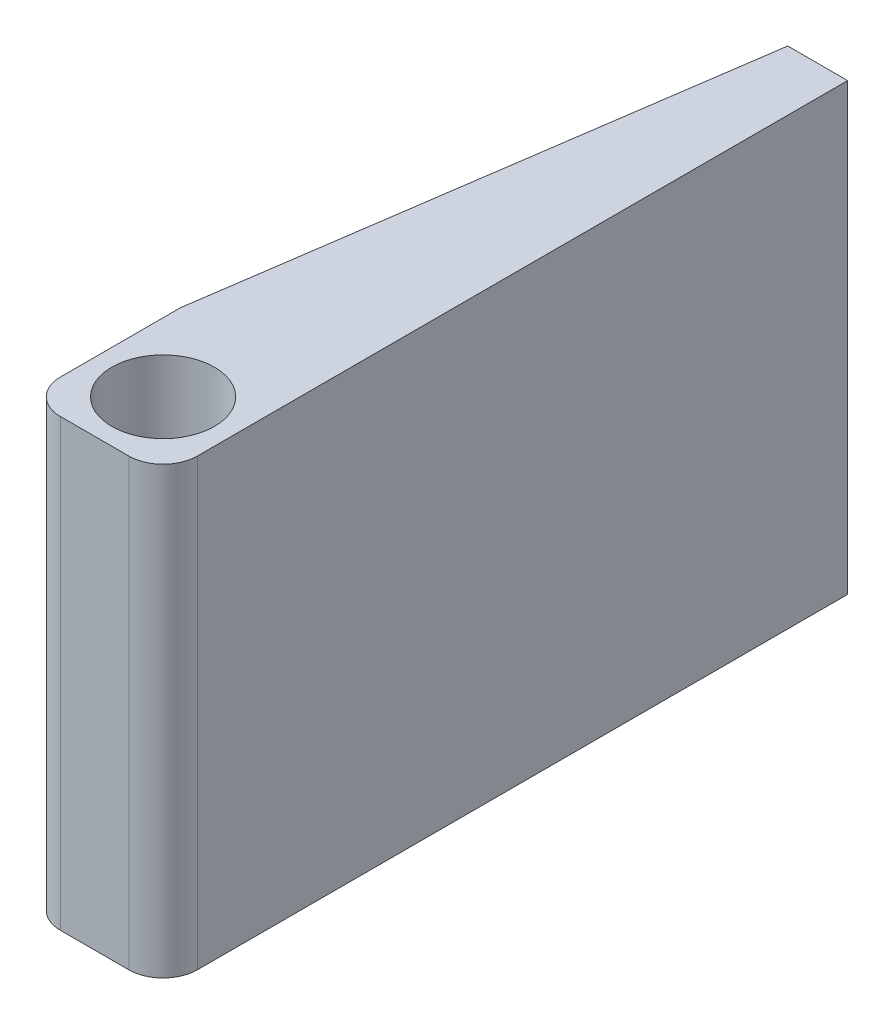
ISO-10303-21;
HEADER;
FILE_DESCRIPTION(('STEP AP214'),'2;1');
FILE_NAME('part.step','',(''),(''),'','','');
FILE_SCHEMA(('AUTOMOTIVE_DESIGN { 1 0 10303 214 1 1 1 1 }'));
ENDSEC;
DATA;
#1=APPLICATION_CONTEXT('core data for automotive mechanical design processes');
#2=APPLICATION_PROTOCOL_DEFINITION('international standard','automotive_design',2000,#1);
#3=PRODUCT_CONTEXT('',#1,'mechanical');
#4=PRODUCT('Part','Part','',(#3));
#5=PRODUCT_RELATED_PRODUCT_CATEGORY('part','',(#4));
#6=PRODUCT_DEFINITION_FORMATION('','',#4);
#7=PRODUCT_DEFINITION_CONTEXT('part definition',#1,'design');
#8=PRODUCT_DEFINITION('design','',#6,#7);
#9=PRODUCT_DEFINITION_SHAPE('','',#8);
#10=(LENGTH_UNIT() NAMED_UNIT(*) SI_UNIT(.MILLI.,.METRE.));
#11=(NAMED_UNIT(*) PLANE_ANGLE_UNIT() SI_UNIT($,.RADIAN.));
#12=(NAMED_UNIT(*) SI_UNIT($,.STERADIAN.) SOLID_ANGLE_UNIT());
#13=UNCERTAINTY_MEASURE_WITH_UNIT(LENGTH_MEASURE(1.E-05),#10,'distance_accuracy_value','');
#14=(GEOMETRIC_REPRESENTATION_CONTEXT(3) GLOBAL_UNCERTAINTY_ASSIGNED_CONTEXT((#13)) GLOBAL_UNIT_ASSIGNED_CONTEXT((#10,
#11,#12)) REPRESENTATION_CONTEXT('',''));
#15=CARTESIAN_POINT('',(0.,0.,0.));
#16=DIRECTION('',(0.,0.,1.));
#17=DIRECTION('',(1.,0.,0.));
#18=AXIS2_PLACEMENT_3D('',#15,#16,#17);
#19=CARTESIAN_POINT('',(101.6,198.344869215292,155.364185110664));
#20=DIRECTION('',(0.,0.,-1.));
#21=DIRECTION('',(0.,1.,0.));
#22=AXIS2_PLACEMENT_3D('',#19,#20,#21);
#23=PLANE('',#22);
#24=DIRECTION('',(-1.,0.,0.));
#25=VECTOR('',#24,1.);
#26=CARTESIAN_POINT('',(101.6,198.344869215292,155.364185110664));
#27=LINE('',#26,#25);
#28=CARTESIAN_POINT('',(76.2,198.344869215292,155.364185110664));
#29=VERTEX_POINT('',#28);
#30=CARTESIAN_POINT('',(25.4,198.344869215292,155.364185110664));
#31=VERTEX_POINT('',#30);
#32=EDGE_CURVE('E183',#29,#31,#27,.T.);
#33=ORIENTED_EDGE('',*,*,#32,.T.);
#34=DIRECTION('',(0.,-1.,0.));
#35=VECTOR('',#34,1.);
#36=CARTESIAN_POINT('',(25.4,198.344869215292,155.364185110664));
#37=LINE('',#36,#35);
#38=CARTESIAN_POINT('',(25.4,-131.855130784708,155.364185110664));
#39=VERTEX_POINT('',#38);
#40=EDGE_CURVE('E200',#31,#39,#37,.T.);
#41=ORIENTED_EDGE('',*,*,#40,.T.);
#42=DIRECTION('',(-1.,0.,0.));
#43=VECTOR('',#42,1.);
#44=CARTESIAN_POINT('',(101.6,-131.855130784708,155.364185110664));
#45=LINE('',#44,#43);
#46=CARTESIAN_POINT('',(76.2,-131.855130784708,155.364185110664));
#47=VERTEX_POINT('',#46);
#48=EDGE_CURVE('E195',#47,#39,#45,.T.);
#49=ORIENTED_EDGE('',*,*,#48,.F.);
#50=DIRECTION('',(0.,-1.,0.));
#51=VECTOR('',#50,1.);
#52=CARTESIAN_POINT('',(76.2,198.344869215292,155.364185110664));
#53=LINE('',#52,#51);
#54=EDGE_CURVE('E198',#47,#29,#53,.F.);
#55=ORIENTED_EDGE('',*,*,#54,.T.);
#56=EDGE_LOOP('',(#33,#41,#49,#55));
#57=FACE_BOUND('',#56,.T.);
#58=ADVANCED_FACE('F39',(#57),#23,.F.);
#59=CARTESIAN_POINT('',(101.6,-131.855130784708,155.364185110664));
#60=DIRECTION('',(0.,1.,0.));
#61=DIRECTION('',(0.,0.,1.));
#62=AXIS2_PLACEMENT_3D('',#59,#60,#61);
#63=PLANE('',#62);
#64=CARTESIAN_POINT('',(50.8,-131.855130784708,104.564185110664));
#65=DIRECTION('',(0.,-1.,0.));
#66=DIRECTION('',(0.,0.,-1.));
#67=AXIS2_PLACEMENT_3D('',#64,#65,#66);
#68=CIRCLE('',#67,38.1);
#69=CARTESIAN_POINT('',(50.8,-131.855130784708,66.464185110664));
#70=VERTEX_POINT('',#69);
#71=EDGE_CURVE('E167',#70,#70,#68,.T.);
#72=ORIENTED_EDGE('',*,*,#71,.F.);
#73=EDGE_LOOP('',(#72));
#74=FACE_BOUND('',#73,.T.);
#75=DIRECTION('',(0.,0.,-1.));
#76=VECTOR('',#75,1.);
#77=CARTESIAN_POINT('',(0.,-131.855130784708,155.364185110664));
#78=LINE('',#77,#76);
#79=CARTESIAN_POINT('',(0.,-131.855130784708,129.964185110664));
#80=VERTEX_POINT('',#79);
#81=CARTESIAN_POINT('',(0.,-131.855130784708,40.9592464621144));
#82=VERTEX_POINT('',#81);
#83=EDGE_CURVE('E172',#80,#82,#78,.T.);
#84=ORIENTED_EDGE('',*,*,#83,.T.);
#85=DIRECTION('',(-0.143693149340155,0.,0.98962229099425));
#86=VECTOR('',#85,1.);
#87=CARTESIAN_POINT('',(0.,-131.855130784708,40.9592464621144));
#88=LINE('',#87,#86);
#89=CARTESIAN_POINT('',(57.15,-131.855130784708,-352.635814889336));
#90=VERTEX_POINT('',#89);
#91=EDGE_CURVE('E62',#90,#82,#88,.T.);
#92=ORIENTED_EDGE('',*,*,#91,.F.);
#93=DIRECTION('',(-1.,0.,0.));
#94=VECTOR('',#93,1.);
#95=CARTESIAN_POINT('',(101.6,-131.855130784708,-352.635814889336));
#96=LINE('',#95,#94);
#97=CARTESIAN_POINT('',(101.6,-131.855130784708,-352.635814889336));
#98=VERTEX_POINT('',#97);
#99=EDGE_CURVE('E192',#98,#90,#96,.T.);
#100=ORIENTED_EDGE('',*,*,#99,.F.);
#101=DIRECTION('',(0.,0.,-1.));
#102=VECTOR('',#101,1.);
#103=CARTESIAN_POINT('',(101.6,-131.855130784708,155.364185110664));
#104=LINE('',#103,#102);
#105=CARTESIAN_POINT('',(101.6,-131.855130784708,129.964185110664));
#106=VERTEX_POINT('',#105);
#107=EDGE_CURVE('E175',#106,#98,#104,.T.);
#108=ORIENTED_EDGE('',*,*,#107,.F.);
#109=CARTESIAN_POINT('',(76.2,-131.855130784708,129.964185110664));
#110=DIRECTION('',(0.,1.,0.));
#111=DIRECTION('',(0.,0.,1.));
#112=AXIS2_PLACEMENT_3D('',#109,#110,#111);
#113=CIRCLE('',#112,25.4);
#114=EDGE_CURVE('E203',#106,#47,#113,.F.);
#115=ORIENTED_EDGE('',*,*,#114,.T.);
#116=ORIENTED_EDGE('',*,*,#48,.T.);
#117=CARTESIAN_POINT('',(25.4,-131.855130784708,129.964185110664));
#118=DIRECTION('',(0.,1.,0.));
#119=DIRECTION('',(0.,0.,1.));
#120=AXIS2_PLACEMENT_3D('',#117,#118,#119);
#121=CIRCLE('',#120,25.4);
#122=EDGE_CURVE('E205',#39,#80,#121,.F.);
#123=ORIENTED_EDGE('',*,*,#122,.T.);
#124=EDGE_LOOP('',(#84,#92,#100,#108,#115,#116,#123));
#125=FACE_BOUND('',#124,.T.);
#126=ADVANCED_FACE('F226',(#74,#125),#63,.F.);
#127=CARTESIAN_POINT('',(101.6,198.344869215292,-352.635814889336));
#128=DIRECTION('',(0.,0.,1.));
#129=DIRECTION('',(0.,-1.,0.));
#130=AXIS2_PLACEMENT_3D('',#127,#128,#129);
#131=PLANE('',#130);
#132=DIRECTION('',(-1.,0.,0.));
#133=VECTOR('',#132,1.);
#134=CARTESIAN_POINT('',(91.44,-4.85513078470822,-352.635814889336));
#135=LINE('',#134,#133);
#136=CARTESIAN_POINT('',(91.44,-4.8551307847082,-352.635814889336));
#137=VERTEX_POINT('',#136);
#138=CARTESIAN_POINT('',(68.3357247994708,-4.85513078470822,-352.635814889336));
#139=VERTEX_POINT('',#138);
#140=EDGE_CURVE('E151',#137,#139,#135,.T.);
#141=ORIENTED_EDGE('',*,*,#140,.F.);
#142=DIRECTION('',(0.,-1.,0.));
#143=VECTOR('',#142,1.);
#144=CARTESIAN_POINT('',(91.44,71.3448692152918,-352.635814889336));
#145=LINE('',#144,#143);
#146=CARTESIAN_POINT('',(91.44,71.3448692152918,-352.635814889336));
#147=VERTEX_POINT('',#146);
#148=EDGE_CURVE('E54',#147,#137,#145,.T.);
#149=ORIENTED_EDGE('',*,*,#148,.F.);
#150=DIRECTION('',(1.,0.,0.));
#151=VECTOR('',#150,1.);
#152=CARTESIAN_POINT('',(91.44,71.3448692152918,-352.635814889336));
#153=LINE('',#152,#151);
#154=CARTESIAN_POINT('',(68.3357247994708,71.3448692152918,-352.635814889336));
#155=VERTEX_POINT('',#154);
#156=EDGE_CURVE('E142',#155,#147,#153,.T.);
#157=ORIENTED_EDGE('',*,*,#156,.F.);
#158=DIRECTION('',(0.,1.,0.));
#159=VECTOR('',#158,1.);
#160=CARTESIAN_POINT('',(68.3357247994708,71.3448692152918,-352.635814889336));
#161=LINE('',#160,#159);
#162=EDGE_CURVE('E145',#139,#155,#161,.T.);
#163=ORIENTED_EDGE('',*,*,#162,.F.);
#164=EDGE_LOOP('',(#141,#149,#157,#163));
#165=FACE_BOUND('',#164,.T.);
#166=ORIENTED_EDGE('',*,*,#99,.T.);
#167=DIRECTION('',(0.,-1.,0.));
#168=VECTOR('',#167,1.);
#169=CARTESIAN_POINT('',(57.15,198.344869215292,-352.635814889336));
#170=LINE('',#169,#168);
#171=CARTESIAN_POINT('',(57.15,198.344869215292,-352.635814889336));
#172=VERTEX_POINT('',#171);
#173=EDGE_CURVE('E163',#172,#90,#170,.T.);
#174=ORIENTED_EDGE('',*,*,#173,.F.);
#175=DIRECTION('',(-1.,0.,0.));
#176=VECTOR('',#175,1.);
#177=CARTESIAN_POINT('',(101.6,198.344869215292,-352.635814889336));
#178=LINE('',#177,#176);
#179=CARTESIAN_POINT('',(101.6,198.344869215292,-352.635814889336));
#180=VERTEX_POINT('',#179);
#181=EDGE_CURVE('E189',#180,#172,#178,.T.);
#182=ORIENTED_EDGE('',*,*,#181,.F.);
#183=DIRECTION('',(0.,1.,0.));
#184=VECTOR('',#183,1.);
#185=CARTESIAN_POINT('',(101.6,198.344869215292,-352.635814889336));
#186=LINE('',#185,#184);
#187=EDGE_CURVE('E177',#98,#180,#186,.T.);
#188=ORIENTED_EDGE('',*,*,#187,.F.);
#189=EDGE_LOOP('',(#166,#174,#182,#188));
#190=FACE_BOUND('',#189,.T.);
#191=ADVANCED_FACE('F235',(#165,#190),#131,.F.);
#192=CARTESIAN_POINT('',(101.6,198.344869215292,155.364185110664));
#193=DIRECTION('',(0.,-1.,0.));
#194=DIRECTION('',(0.,0.,-1.));
#195=AXIS2_PLACEMENT_3D('',#192,#193,#194);
#196=PLANE('',#195);
#197=CARTESIAN_POINT('',(50.8,198.344869215292,104.564185110664));
#198=DIRECTION('',(0.,-1.,0.));
#199=DIRECTION('',(0.,0.,-1.));
#200=AXIS2_PLACEMENT_3D('',#197,#198,#199);
#201=CIRCLE('',#200,38.1);
#202=CARTESIAN_POINT('',(50.8,198.344869215292,66.464185110664));
#203=VERTEX_POINT('',#202);
#204=EDGE_CURVE('E169',#203,#203,#201,.T.);
#205=ORIENTED_EDGE('',*,*,#204,.T.);
#206=EDGE_LOOP('',(#205));
#207=FACE_BOUND('',#206,.T.);
#208=ORIENTED_EDGE('',*,*,#181,.T.);
#209=DIRECTION('',(-0.143693149340155,0.,0.98962229099425));
#210=VECTOR('',#209,1.);
#211=CARTESIAN_POINT('',(0.,198.344869215292,40.9592464621144));
#212=LINE('',#211,#210);
#213=CARTESIAN_POINT('',(0.,198.344869215292,40.9592464621144));
#214=VERTEX_POINT('',#213);
#215=EDGE_CURVE('E160',#172,#214,#212,.T.);
#216=ORIENTED_EDGE('',*,*,#215,.T.);
#217=DIRECTION('',(0.,0.,1.));
#218=VECTOR('',#217,1.);
#219=CARTESIAN_POINT('',(0.,198.344869215292,155.364185110664));
#220=LINE('',#219,#218);
#221=CARTESIAN_POINT('',(0.,198.344869215292,129.964185110664));
#222=VERTEX_POINT('',#221);
#223=EDGE_CURVE('E178',#214,#222,#220,.T.);
#224=ORIENTED_EDGE('',*,*,#223,.T.);
#225=CARTESIAN_POINT('',(25.4,198.344869215292,129.964185110664));
#226=DIRECTION('',(0.,-1.,0.));
#227=DIRECTION('',(0.,0.,-1.));
#228=AXIS2_PLACEMENT_3D('',#225,#226,#227);
#229=CIRCLE('',#228,25.4);
#230=EDGE_CURVE('E47',#222,#31,#229,.F.);
#231=ORIENTED_EDGE('',*,*,#230,.T.);
#232=ORIENTED_EDGE('',*,*,#32,.F.);
#233=CARTESIAN_POINT('',(76.2,198.344869215292,129.964185110664));
#234=DIRECTION('',(0.,-1.,0.));
#235=DIRECTION('',(0.,0.,-1.));
#236=AXIS2_PLACEMENT_3D('',#233,#234,#235);
#237=CIRCLE('',#236,25.4);
#238=CARTESIAN_POINT('',(101.6,198.344869215292,129.964185110664));
#239=VERTEX_POINT('',#238);
#240=EDGE_CURVE('E210',#29,#239,#237,.F.);
#241=ORIENTED_EDGE('',*,*,#240,.T.);
#242=DIRECTION('',(0.,0.,1.));
#243=VECTOR('',#242,1.);
#244=CARTESIAN_POINT('',(101.6,198.344869215292,155.364185110664));
#245=LINE('',#244,#243);
#246=EDGE_CURVE('E180',#180,#239,#245,.T.);
#247=ORIENTED_EDGE('',*,*,#246,.F.);
#248=EDGE_LOOP('',(#208,#216,#224,#231,#232,#241,#247));
#249=FACE_BOUND('',#248,.T.);
#250=ADVANCED_FACE('F214',(#207,#249),#196,.F.);
#251=CARTESIAN_POINT('',(101.6,0.,0.));
#252=DIRECTION('',(1.,0.,0.));
#253=DIRECTION('',(0.,0.,-1.));
#254=AXIS2_PLACEMENT_3D('',#251,#252,#253);
#255=PLANE('',#254);
#256=ORIENTED_EDGE('',*,*,#246,.T.);
#257=DIRECTION('',(0.,-1.,0.));
#258=VECTOR('',#257,1.);
#259=CARTESIAN_POINT('',(101.6,-131.855130784708,129.964185110664));
#260=LINE('',#259,#258);
#261=EDGE_CURVE('E11',#239,#106,#260,.T.);
#262=ORIENTED_EDGE('',*,*,#261,.T.);
#263=ORIENTED_EDGE('',*,*,#107,.T.);
#264=ORIENTED_EDGE('',*,*,#187,.T.);
#265=EDGE_LOOP('',(#256,#262,#263,#264));
#266=FACE_BOUND('',#265,.T.);
#267=ADVANCED_FACE('F239',(#266),#255,.T.);
#268=CARTESIAN_POINT('',(0.,0.,0.));
#269=DIRECTION('',(1.,0.,0.));
#270=DIRECTION('',(0.,0.,-1.));
#271=AXIS2_PLACEMENT_3D('',#268,#269,#270);
#272=PLANE('',#271);
#273=ORIENTED_EDGE('',*,*,#223,.F.);
#274=DIRECTION('',(0.,-1.,0.));
#275=VECTOR('',#274,1.);
#276=CARTESIAN_POINT('',(0.,198.344869215292,40.9592464621144));
#277=LINE('',#276,#275);
#278=EDGE_CURVE('E165',#214,#82,#277,.T.);
#279=ORIENTED_EDGE('',*,*,#278,.T.);
#280=ORIENTED_EDGE('',*,*,#83,.F.);
#281=DIRECTION('',(0.,-1.,0.));
#282=VECTOR('',#281,1.);
#283=CARTESIAN_POINT('',(0.,0.,129.964185110664));
#284=LINE('',#283,#282);
#285=EDGE_CURVE('E207',#80,#222,#284,.F.);
#286=ORIENTED_EDGE('',*,*,#285,.T.);
#287=EDGE_LOOP('',(#273,#279,#280,#286));
#288=FACE_BOUND('',#287,.T.);
#289=ADVANCED_FACE('F228',(#288),#272,.F.);
#290=CARTESIAN_POINT('',(50.8,198.344869215292,104.564185110664));
#291=DIRECTION('',(0.,-1.,0.));
#292=DIRECTION('',(0.,0.,-1.));
#293=AXIS2_PLACEMENT_3D('',#290,#291,#292);
#294=CYLINDRICAL_SURFACE('',#293,38.1);
#295=ORIENTED_EDGE('',*,*,#204,.F.);
#296=EDGE_LOOP('',(#295));
#297=FACE_BOUND('',#296,.T.);
#298=ORIENTED_EDGE('',*,*,#71,.T.);
#299=EDGE_LOOP('',(#298));
#300=FACE_BOUND('',#299,.T.);
#301=ADVANCED_FACE('F249',(#297,#300),#294,.F.);
#302=CARTESIAN_POINT('',(25.4,198.344869215292,129.964185110664));
#303=DIRECTION('',(0.,-1.,0.));
#304=DIRECTION('',(0.,0.,-1.));
#305=AXIS2_PLACEMENT_3D('',#302,#303,#304);
#306=CYLINDRICAL_SURFACE('',#305,25.4);
#307=ORIENTED_EDGE('',*,*,#230,.F.);
#308=ORIENTED_EDGE('',*,*,#285,.F.);
#309=ORIENTED_EDGE('',*,*,#122,.F.);
#310=ORIENTED_EDGE('',*,*,#40,.F.);
#311=EDGE_LOOP('',(#307,#308,#309,#310));
#312=FACE_BOUND('',#311,.T.);
#313=ADVANCED_FACE('F223',(#312),#306,.T.);
#314=CARTESIAN_POINT('',(76.2,0.,129.964185110664));
#315=DIRECTION('',(0.,1.,0.));
#316=DIRECTION('',(0.,0.,1.));
#317=AXIS2_PLACEMENT_3D('',#314,#315,#316);
#318=CYLINDRICAL_SURFACE('',#317,25.4);
#319=ORIENTED_EDGE('',*,*,#240,.F.);
#320=ORIENTED_EDGE('',*,*,#54,.F.);
#321=ORIENTED_EDGE('',*,*,#114,.F.);
#322=ORIENTED_EDGE('',*,*,#261,.F.);
#323=EDGE_LOOP('',(#319,#320,#321,#322));
#324=FACE_BOUND('',#323,.T.);
#325=ADVANCED_FACE('F41',(#324),#318,.T.);
#326=CARTESIAN_POINT('',(0.,198.344869215292,40.9592464621144));
#327=DIRECTION('',(0.98962229099425,0.,0.143693149340155));
#328=DIRECTION('',(0.143693149340155,0.,-0.98962229099425));
#329=AXIS2_PLACEMENT_3D('',#326,#327,#328);
#330=PLANE('',#329);
#331=ORIENTED_EDGE('',*,*,#91,.T.);
#332=ORIENTED_EDGE('',*,*,#278,.F.);
#333=ORIENTED_EDGE('',*,*,#215,.F.);
#334=ORIENTED_EDGE('',*,*,#173,.T.);
#335=EDGE_LOOP('',(#331,#332,#333,#334));
#336=FACE_BOUND('',#335,.T.);
#337=ADVANCED_FACE('F229',(#336),#330,.F.);
#338=CARTESIAN_POINT('',(91.44,71.3448692152918,-301.835814889336));
#339=DIRECTION('',(1.,0.,0.));
#340=DIRECTION('',(0.,1.,0.));
#341=AXIS2_PLACEMENT_3D('',#338,#339,#340);
#342=PLANE('',#341);
#343=ORIENTED_EDGE('',*,*,#148,.T.);
#344=DIRECTION('',(0.,0.,-1.));
#345=VECTOR('',#344,1.);
#346=CARTESIAN_POINT('',(91.44,-4.85513078470824,-301.835814889336));
#347=LINE('',#346,#345);
#348=CARTESIAN_POINT('',(91.44,-4.85513078470824,-301.835814889336));
#349=VERTEX_POINT('',#348);
#350=EDGE_CURVE('E120',#349,#137,#347,.T.);
#351=ORIENTED_EDGE('',*,*,#350,.F.);
#352=DIRECTION('',(0.,-1.,0.));
#353=VECTOR('',#352,1.);
#354=CARTESIAN_POINT('',(91.44,71.3448692152918,-301.835814889336));
#355=LINE('',#354,#353);
#356=CARTESIAN_POINT('',(91.44,71.3448692152918,-301.835814889336));
#357=VERTEX_POINT('',#356);
#358=EDGE_CURVE('E124',#357,#349,#355,.T.);
#359=ORIENTED_EDGE('',*,*,#358,.F.);
#360=DIRECTION('',(0.,0.,-1.));
#361=VECTOR('',#360,1.);
#362=CARTESIAN_POINT('',(91.44,71.3448692152918,-301.835814889336));
#363=LINE('',#362,#361);
#364=EDGE_CURVE('E155',#357,#147,#363,.T.);
#365=ORIENTED_EDGE('',*,*,#364,.T.);
#366=EDGE_LOOP('',(#343,#351,#359,#365));
#367=FACE_BOUND('',#366,.T.);
#368=ADVANCED_FACE('F122',(#367),#342,.F.);
#369=CARTESIAN_POINT('',(91.44,71.3448692152918,-301.835814889336));
#370=DIRECTION('',(0.,1.,0.));
#371=DIRECTION('',(0.,0.,1.));
#372=AXIS2_PLACEMENT_3D('',#369,#370,#371);
#373=PLANE('',#372);
#374=ORIENTED_EDGE('',*,*,#156,.T.);
#375=ORIENTED_EDGE('',*,*,#364,.F.);
#376=DIRECTION('',(1.,0.,0.));
#377=VECTOR('',#376,1.);
#378=CARTESIAN_POINT('',(91.44,71.3448692152918,-301.835814889336));
#379=LINE('',#378,#377);
#380=CARTESIAN_POINT('',(68.3357247994708,71.3448692152918,-301.835814889336));
#381=VERTEX_POINT('',#380);
#382=EDGE_CURVE('E130',#381,#357,#379,.T.);
#383=ORIENTED_EDGE('',*,*,#382,.F.);
#384=DIRECTION('',(0.,0.,-1.));
#385=VECTOR('',#384,1.);
#386=CARTESIAN_POINT('',(68.3357247994708,71.3448692152918,-301.835814889336));
#387=LINE('',#386,#385);
#388=EDGE_CURVE('E157',#381,#155,#387,.T.);
#389=ORIENTED_EDGE('',*,*,#388,.T.);
#390=EDGE_LOOP('',(#374,#375,#383,#389));
#391=FACE_BOUND('',#390,.T.);
#392=ADVANCED_FACE('F272',(#391),#373,.F.);
#393=CARTESIAN_POINT('',(68.3357247994708,71.3448692152918,-301.835814889336));
#394=DIRECTION('',(-1.,0.,0.));
#395=DIRECTION('',(0.,-1.,0.));
#396=AXIS2_PLACEMENT_3D('',#393,#394,#395);
#397=PLANE('',#396);
#398=ORIENTED_EDGE('',*,*,#162,.T.);
#399=ORIENTED_EDGE('',*,*,#388,.F.);
#400=DIRECTION('',(0.,1.,0.));
#401=VECTOR('',#400,1.);
#402=CARTESIAN_POINT('',(68.3357247994708,71.3448692152918,-301.835814889336));
#403=LINE('',#402,#401);
#404=CARTESIAN_POINT('',(68.3357247994708,-4.85513078470824,-301.835814889336));
#405=VERTEX_POINT('',#404);
#406=EDGE_CURVE('E138',#405,#381,#403,.T.);
#407=ORIENTED_EDGE('',*,*,#406,.F.);
#408=DIRECTION('',(0.,0.,-1.));
#409=VECTOR('',#408,1.);
#410=CARTESIAN_POINT('',(68.3357247994708,-4.85513078470824,-301.835814889336));
#411=LINE('',#410,#409);
#412=EDGE_CURVE('E129',#405,#139,#411,.T.);
#413=ORIENTED_EDGE('',*,*,#412,.T.);
#414=EDGE_LOOP('',(#398,#399,#407,#413));
#415=FACE_BOUND('',#414,.T.);
#416=ADVANCED_FACE('F275',(#415),#397,.F.);
#417=CARTESIAN_POINT('',(91.44,-4.85513078470824,-301.835814889336));
#418=DIRECTION('',(0.,-1.,0.));
#419=DIRECTION('',(0.,0.,-1.));
#420=AXIS2_PLACEMENT_3D('',#417,#418,#419);
#421=PLANE('',#420);
#422=ORIENTED_EDGE('',*,*,#140,.T.);
#423=ORIENTED_EDGE('',*,*,#412,.F.);
#424=DIRECTION('',(-1.,0.,0.));
#425=VECTOR('',#424,1.);
#426=CARTESIAN_POINT('',(91.44,-4.85513078470824,-301.835814889336));
#427=LINE('',#426,#425);
#428=EDGE_CURVE('E133',#349,#405,#427,.T.);
#429=ORIENTED_EDGE('',*,*,#428,.F.);
#430=ORIENTED_EDGE('',*,*,#350,.T.);
#431=EDGE_LOOP('',(#422,#423,#429,#430));
#432=FACE_BOUND('',#431,.T.);
#433=ADVANCED_FACE('F134',(#432),#421,.F.);
#434=CARTESIAN_POINT('',(0.,0.,-301.835814889336));
#435=DIRECTION('',(0.,0.,-1.));
#436=DIRECTION('',(-1.,0.,0.));
#437=AXIS2_PLACEMENT_3D('',#434,#435,#436);
#438=PLANE('',#437);
#439=ORIENTED_EDGE('',*,*,#358,.T.);
#440=ORIENTED_EDGE('',*,*,#428,.T.);
#441=ORIENTED_EDGE('',*,*,#406,.T.);
#442=ORIENTED_EDGE('',*,*,#382,.T.);
#443=EDGE_LOOP('',(#439,#440,#441,#442));
#444=FACE_BOUND('',#443,.T.);
#445=ADVANCED_FACE('F140',(#444),#438,.T.);
#446=CLOSED_SHELL('',(#58,#126,#191,#250,#267,#289,#301,#313,#325,#337,#368,#392,#416,#433,#445));
#447=MANIFOLD_SOLID_BREP('B2',#446);
#448=ADVANCED_BREP_SHAPE_REPRESENTATION('',(#18,#447),#14);
#449=SHAPE_DEFINITION_REPRESENTATION(#9,#448);
ENDSEC;
END-ISO-10303-21;
